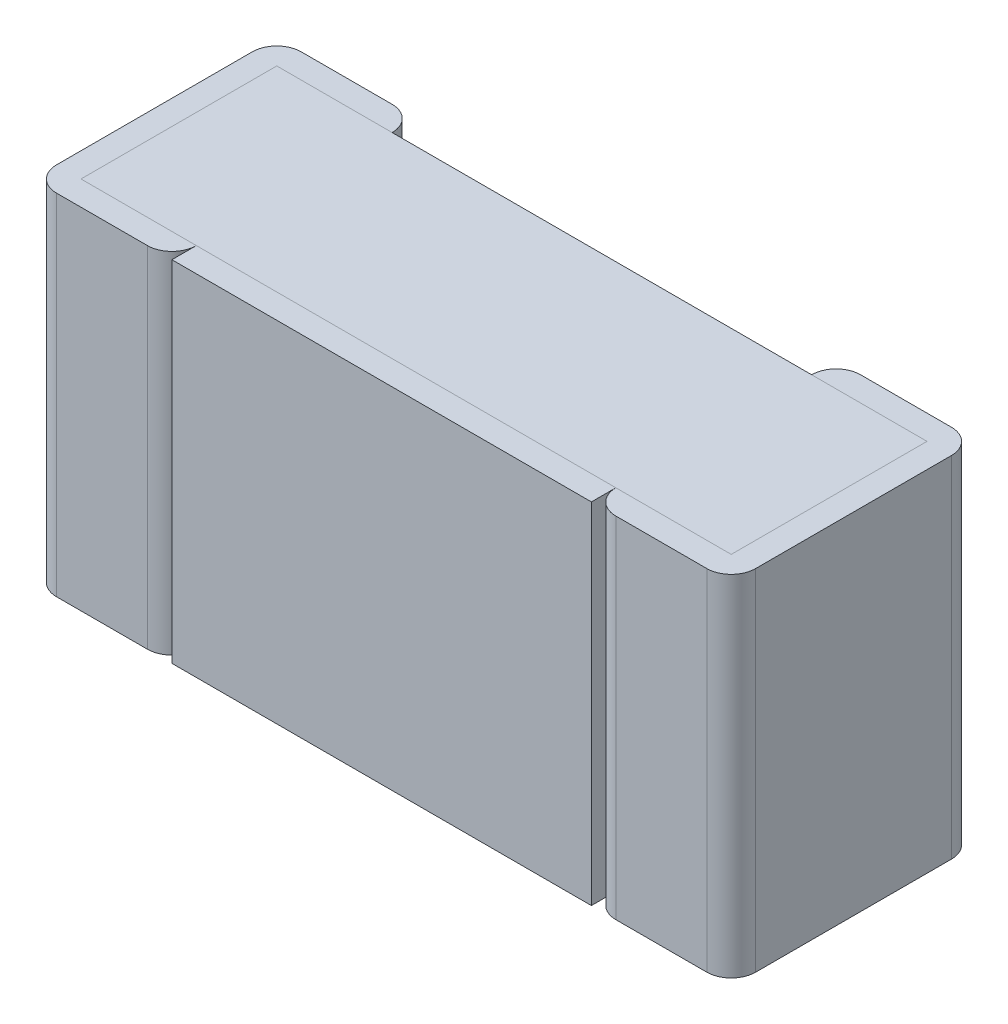
ISO-10303-21;
HEADER;
FILE_DESCRIPTION(('STEP AP214'),'2;1');
FILE_NAME('part.step','',(''),(''),'','','');
FILE_SCHEMA(('AUTOMOTIVE_DESIGN { 1 0 10303 214 1 1 1 1 }'));
ENDSEC;
DATA;
#1=APPLICATION_CONTEXT('core data for automotive mechanical design processes');
#2=APPLICATION_PROTOCOL_DEFINITION('international standard','automotive_design',2000,#1);
#3=PRODUCT_CONTEXT('',#1,'mechanical');
#4=PRODUCT('Part','Part','',(#3));
#5=PRODUCT_RELATED_PRODUCT_CATEGORY('part','',(#4));
#6=PRODUCT_DEFINITION_FORMATION('','',#4);
#7=PRODUCT_DEFINITION_CONTEXT('part definition',#1,'design');
#8=PRODUCT_DEFINITION('design','',#6,#7);
#9=PRODUCT_DEFINITION_SHAPE('','',#8);
#10=(LENGTH_UNIT() NAMED_UNIT(*) SI_UNIT(.MILLI.,.METRE.));
#11=(NAMED_UNIT(*) PLANE_ANGLE_UNIT() SI_UNIT($,.RADIAN.));
#12=(NAMED_UNIT(*) SI_UNIT($,.STERADIAN.) SOLID_ANGLE_UNIT());
#13=UNCERTAINTY_MEASURE_WITH_UNIT(LENGTH_MEASURE(1.E-05),#10,'distance_accuracy_value','');
#14=(GEOMETRIC_REPRESENTATION_CONTEXT(3) GLOBAL_UNCERTAINTY_ASSIGNED_CONTEXT((#13)) GLOBAL_UNIT_ASSIGNED_CONTEXT((#10,
#11,#12)) REPRESENTATION_CONTEXT('',''));
#15=CARTESIAN_POINT('',(0.,0.,0.));
#16=DIRECTION('',(0.,0.,1.));
#17=DIRECTION('',(1.,0.,0.));
#18=AXIS2_PLACEMENT_3D('',#15,#16,#17);
#19=CARTESIAN_POINT('',(-0.3,-0.25,0.35));
#20=DIRECTION('',(0.,0.,1.));
#21=DIRECTION('',(1.,0.,0.));
#22=AXIS2_PLACEMENT_3D('',#19,#20,#21);
#23=PLANE('',#22);
#24=DIRECTION('',(0.,1.,0.));
#25=VECTOR('',#24,1.);
#26=CARTESIAN_POINT('',(-0.3,-0.25,0.35));
#27=LINE('',#26,#25);
#28=CARTESIAN_POINT('',(-0.3,-0.25,0.35));
#29=VERTEX_POINT('',#28);
#30=CARTESIAN_POINT('',(-0.3,0.25,0.35));
#31=VERTEX_POINT('',#30);
#32=EDGE_CURVE('E144',#29,#31,#27,.T.);
#33=ORIENTED_EDGE('',*,*,#32,.F.);
#34=DIRECTION('',(1.,0.,0.));
#35=VECTOR('',#34,1.);
#36=CARTESIAN_POINT('',(-0.3,-0.25,0.35));
#37=LINE('',#36,#35);
#38=CARTESIAN_POINT('',(0.3,-0.25,0.35));
#39=VERTEX_POINT('',#38);
#40=EDGE_CURVE('E347',#29,#39,#37,.T.);
#41=ORIENTED_EDGE('',*,*,#40,.T.);
#42=DIRECTION('',(0.,1.,0.));
#43=VECTOR('',#42,1.);
#44=CARTESIAN_POINT('',(0.3,-0.25,0.35));
#45=LINE('',#44,#43);
#46=CARTESIAN_POINT('',(0.3,0.25,0.35));
#47=VERTEX_POINT('',#46);
#48=EDGE_CURVE('E11',#39,#47,#45,.T.);
#49=ORIENTED_EDGE('',*,*,#48,.T.);
#50=DIRECTION('',(1.,0.,0.));
#51=VECTOR('',#50,1.);
#52=CARTESIAN_POINT('',(-0.3,0.25,0.35));
#53=LINE('',#52,#51);
#54=EDGE_CURVE('E263',#31,#47,#53,.T.);
#55=ORIENTED_EDGE('',*,*,#54,.F.);
#56=EDGE_LOOP('',(#33,#41,#49,#55));
#57=FACE_BOUND('',#56,.T.);
#58=ADVANCED_FACE('F17',(#57),#23,.T.);
#59=CARTESIAN_POINT('',(0.3,-0.25,0.315));
#60=DIRECTION('',(1.,0.,0.));
#61=DIRECTION('',(0.,1.,0.));
#62=AXIS2_PLACEMENT_3D('',#59,#60,#61);
#63=PLANE('',#62);
#64=DIRECTION('',(0.,0.,1.));
#65=VECTOR('',#64,1.);
#66=CARTESIAN_POINT('',(0.3,-0.25,0.315));
#67=LINE('',#66,#65);
#68=CARTESIAN_POINT('',(0.3,-0.25,0.315));
#69=VERTEX_POINT('',#68);
#70=EDGE_CURVE('E279',#69,#39,#67,.T.);
#71=ORIENTED_EDGE('',*,*,#70,.F.);
#72=DIRECTION('',(0.,1.,0.));
#73=VECTOR('',#72,1.);
#74=CARTESIAN_POINT('',(0.3,-0.25,0.315));
#75=LINE('',#74,#73);
#76=CARTESIAN_POINT('',(0.3,0.25,0.315));
#77=VERTEX_POINT('',#76);
#78=EDGE_CURVE('E28',#69,#77,#75,.T.);
#79=ORIENTED_EDGE('',*,*,#78,.T.);
#80=DIRECTION('',(0.,0.,1.));
#81=VECTOR('',#80,1.);
#82=CARTESIAN_POINT('',(0.3,0.25,0.315));
#83=LINE('',#82,#81);
#84=EDGE_CURVE('E267',#77,#47,#83,.T.);
#85=ORIENTED_EDGE('',*,*,#84,.T.);
#86=ORIENTED_EDGE('',*,*,#48,.F.);
#87=EDGE_LOOP('',(#71,#79,#85,#86));
#88=FACE_BOUND('',#87,.T.);
#89=ADVANCED_FACE('F500',(#88),#63,.T.);
#90=CARTESIAN_POINT('',(0.335,-0.25,0.315));
#91=DIRECTION('',(0.,1.,0.));
#92=DIRECTION('',(-1.,0.,0.));
#93=AXIS2_PLACEMENT_3D('',#90,#91,#92);
#94=CYLINDRICAL_SURFACE('',#93,0.035);
#95=CARTESIAN_POINT('',(0.335,-0.25,0.315));
#96=DIRECTION('',(0.,1.,0.));
#97=DIRECTION('',(0.,0.,1.));
#98=AXIS2_PLACEMENT_3D('',#95,#96,#97);
#99=CIRCLE('',#98,0.035);
#100=CARTESIAN_POINT('',(0.335,-0.25,0.35));
#101=VERTEX_POINT('',#100);
#102=EDGE_CURVE('E294',#69,#101,#99,.T.);
#103=ORIENTED_EDGE('',*,*,#102,.T.);
#104=DIRECTION('',(0.,1.,0.));
#105=VECTOR('',#104,1.);
#106=CARTESIAN_POINT('',(0.335,-0.25,0.35));
#107=LINE('',#106,#105);
#108=CARTESIAN_POINT('',(0.335,0.25,0.35));
#109=VERTEX_POINT('',#108);
#110=EDGE_CURVE('E331',#101,#109,#107,.T.);
#111=ORIENTED_EDGE('',*,*,#110,.T.);
#112=CARTESIAN_POINT('',(0.335,0.25,0.315));
#113=DIRECTION('',(0.,1.,0.));
#114=DIRECTION('',(0.,0.,1.));
#115=AXIS2_PLACEMENT_3D('',#112,#113,#114);
#116=CIRCLE('',#115,0.035);
#117=EDGE_CURVE('E314',#77,#109,#116,.T.);
#118=ORIENTED_EDGE('',*,*,#117,.F.);
#119=ORIENTED_EDGE('',*,*,#78,.F.);
#120=EDGE_LOOP('',(#103,#111,#118,#119));
#121=FACE_BOUND('',#120,.T.);
#122=ADVANCED_FACE('F479',(#121),#94,.T.);
#123=CARTESIAN_POINT('',(0.3,-0.25,0.35));
#124=DIRECTION('',(0.,0.,1.));
#125=DIRECTION('',(1.,0.,0.));
#126=AXIS2_PLACEMENT_3D('',#123,#124,#125);
#127=PLANE('',#126);
#128=DIRECTION('',(1.,0.,0.));
#129=VECTOR('',#128,1.);
#130=CARTESIAN_POINT('',(0.3,0.25,0.35));
#131=LINE('',#130,#129);
#132=CARTESIAN_POINT('',(0.465,0.25,0.35));
#133=VERTEX_POINT('',#132);
#134=EDGE_CURVE('E256',#109,#133,#131,.T.);
#135=ORIENTED_EDGE('',*,*,#134,.F.);
#136=ORIENTED_EDGE('',*,*,#110,.F.);
#137=DIRECTION('',(1.,0.,0.));
#138=VECTOR('',#137,1.);
#139=CARTESIAN_POINT('',(0.3,-0.25,0.35));
#140=LINE('',#139,#138);
#141=CARTESIAN_POINT('',(0.465,-0.25,0.35));
#142=VERTEX_POINT('',#141);
#143=EDGE_CURVE('E359',#101,#142,#140,.T.);
#144=ORIENTED_EDGE('',*,*,#143,.T.);
#145=DIRECTION('',(0.,1.,0.));
#146=VECTOR('',#145,1.);
#147=CARTESIAN_POINT('',(0.465,-0.25,0.35));
#148=LINE('',#147,#146);
#149=EDGE_CURVE('E467',#142,#133,#148,.T.);
#150=ORIENTED_EDGE('',*,*,#149,.T.);
#151=EDGE_LOOP('',(#135,#136,#144,#150));
#152=FACE_BOUND('',#151,.T.);
#153=ADVANCED_FACE('F485',(#152),#127,.T.);
#154=CARTESIAN_POINT('',(0.465,-0.25,0.315));
#155=DIRECTION('',(0.,1.,0.));
#156=DIRECTION('',(1.,0.,0.));
#157=AXIS2_PLACEMENT_3D('',#154,#155,#156);
#158=CYLINDRICAL_SURFACE('',#157,0.035);
#159=DIRECTION('',(0.,1.,0.));
#160=VECTOR('',#159,1.);
#161=CARTESIAN_POINT('',(0.5,-0.25,0.315));
#162=LINE('',#161,#160);
#163=CARTESIAN_POINT('',(0.5,-0.25,0.315));
#164=VERTEX_POINT('',#163);
#165=CARTESIAN_POINT('',(0.5,0.25,0.315));
#166=VERTEX_POINT('',#165);
#167=EDGE_CURVE('E328',#164,#166,#162,.T.);
#168=ORIENTED_EDGE('',*,*,#167,.T.);
#169=CARTESIAN_POINT('',(0.465,0.25,0.315));
#170=DIRECTION('',(0.,-1.,0.));
#171=DIRECTION('',(0.,0.,1.));
#172=AXIS2_PLACEMENT_3D('',#169,#170,#171);
#173=CIRCLE('',#172,0.035);
#174=EDGE_CURVE('E21',#166,#133,#173,.T.);
#175=ORIENTED_EDGE('',*,*,#174,.T.);
#176=ORIENTED_EDGE('',*,*,#149,.F.);
#177=CARTESIAN_POINT('',(0.465,-0.25,0.315));
#178=DIRECTION('',(0.,-1.,0.));
#179=DIRECTION('',(0.,0.,1.));
#180=AXIS2_PLACEMENT_3D('',#177,#178,#179);
#181=CIRCLE('',#180,0.035);
#182=EDGE_CURVE('E325',#164,#142,#181,.T.);
#183=ORIENTED_EDGE('',*,*,#182,.F.);
#184=EDGE_LOOP('',(#168,#175,#176,#183));
#185=FACE_BOUND('',#184,.T.);
#186=ADVANCED_FACE('F508',(#185),#158,.T.);
#187=CARTESIAN_POINT('',(0.5,-0.25,0.));
#188=DIRECTION('',(1.,0.,0.));
#189=DIRECTION('',(0.,1.,0.));
#190=AXIS2_PLACEMENT_3D('',#187,#188,#189);
#191=PLANE('',#190);
#192=DIRECTION('',(0.,0.,1.));
#193=VECTOR('',#192,1.);
#194=CARTESIAN_POINT('',(0.5,-0.25,0.));
#195=LINE('',#194,#193);
#196=CARTESIAN_POINT('',(0.5,-0.25,0.035));
#197=VERTEX_POINT('',#196);
#198=EDGE_CURVE('E321',#197,#164,#195,.T.);
#199=ORIENTED_EDGE('',*,*,#198,.F.);
#200=DIRECTION('',(0.,1.,0.));
#201=VECTOR('',#200,1.);
#202=CARTESIAN_POINT('',(0.5,-0.25,0.035));
#203=LINE('',#202,#201);
#204=CARTESIAN_POINT('',(0.5,0.25,0.035));
#205=VERTEX_POINT('',#204);
#206=EDGE_CURVE('E319',#197,#205,#203,.T.);
#207=ORIENTED_EDGE('',*,*,#206,.T.);
#208=DIRECTION('',(0.,0.,1.));
#209=VECTOR('',#208,1.);
#210=CARTESIAN_POINT('',(0.5,0.25,0.));
#211=LINE('',#210,#209);
#212=EDGE_CURVE('E390',#205,#166,#211,.T.);
#213=ORIENTED_EDGE('',*,*,#212,.T.);
#214=ORIENTED_EDGE('',*,*,#167,.F.);
#215=EDGE_LOOP('',(#199,#207,#213,#214));
#216=FACE_BOUND('',#215,.T.);
#217=ADVANCED_FACE('F600',(#216),#191,.T.);
#218=CARTESIAN_POINT('',(0.465,-0.25,0.035));
#219=DIRECTION('',(0.,1.,0.));
#220=DIRECTION('',(1.,0.,0.));
#221=AXIS2_PLACEMENT_3D('',#218,#219,#220);
#222=CYLINDRICAL_SURFACE('',#221,0.035);
#223=CARTESIAN_POINT('',(0.465,-0.25,0.035));
#224=DIRECTION('',(0.,1.,0.));
#225=DIRECTION('',(0.,0.,1.));
#226=AXIS2_PLACEMENT_3D('',#223,#224,#225);
#227=CIRCLE('',#226,0.035);
#228=CARTESIAN_POINT('',(0.465,-0.25,0.));
#229=VERTEX_POINT('',#228);
#230=EDGE_CURVE('E261',#197,#229,#227,.T.);
#231=ORIENTED_EDGE('',*,*,#230,.T.);
#232=DIRECTION('',(0.,1.,0.));
#233=VECTOR('',#232,1.);
#234=CARTESIAN_POINT('',(0.465,-0.25,0.));
#235=LINE('',#234,#233);
#236=CARTESIAN_POINT('',(0.465,0.25,0.));
#237=VERTEX_POINT('',#236);
#238=EDGE_CURVE('E316',#229,#237,#235,.T.);
#239=ORIENTED_EDGE('',*,*,#238,.T.);
#240=CARTESIAN_POINT('',(0.465,0.25,0.035));
#241=DIRECTION('',(0.,1.,0.));
#242=DIRECTION('',(0.,0.,1.));
#243=AXIS2_PLACEMENT_3D('',#240,#241,#242);
#244=CIRCLE('',#243,0.035);
#245=EDGE_CURVE('E268',#205,#237,#244,.T.);
#246=ORIENTED_EDGE('',*,*,#245,.F.);
#247=ORIENTED_EDGE('',*,*,#206,.F.);
#248=EDGE_LOOP('',(#231,#239,#246,#247));
#249=FACE_BOUND('',#248,.T.);
#250=ADVANCED_FACE('F19',(#249),#222,.T.);
#251=CARTESIAN_POINT('',(0.3,-0.25,0.));
#252=DIRECTION('',(0.,0.,1.));
#253=DIRECTION('',(1.,0.,0.));
#254=AXIS2_PLACEMENT_3D('',#251,#252,#253);
#255=PLANE('',#254);
#256=ORIENTED_EDGE('',*,*,#238,.F.);
#257=DIRECTION('',(1.,0.,0.));
#258=VECTOR('',#257,1.);
#259=CARTESIAN_POINT('',(0.3,-0.25,0.));
#260=LINE('',#259,#258);
#261=CARTESIAN_POINT('',(0.335,-0.25,0.));
#262=VERTEX_POINT('',#261);
#263=EDGE_CURVE('E275',#262,#229,#260,.T.);
#264=ORIENTED_EDGE('',*,*,#263,.F.);
#265=DIRECTION('',(0.,1.,0.));
#266=VECTOR('',#265,1.);
#267=CARTESIAN_POINT('',(0.335,-0.25,0.));
#268=LINE('',#267,#266);
#269=CARTESIAN_POINT('',(0.335,0.25,0.));
#270=VERTEX_POINT('',#269);
#271=EDGE_CURVE('E320',#262,#270,#268,.T.);
#272=ORIENTED_EDGE('',*,*,#271,.T.);
#273=DIRECTION('',(1.,0.,0.));
#274=VECTOR('',#273,1.);
#275=CARTESIAN_POINT('',(0.3,0.25,0.));
#276=LINE('',#275,#274);
#277=EDGE_CURVE('E315',#270,#237,#276,.T.);
#278=ORIENTED_EDGE('',*,*,#277,.T.);
#279=EDGE_LOOP('',(#256,#264,#272,#278));
#280=FACE_BOUND('',#279,.T.);
#281=ADVANCED_FACE('F641',(#280),#255,.F.);
#282=CARTESIAN_POINT('',(0.335,-0.25,0.035));
#283=DIRECTION('',(0.,1.,0.));
#284=DIRECTION('',(-1.,0.,0.));
#285=AXIS2_PLACEMENT_3D('',#282,#283,#284);
#286=CYLINDRICAL_SURFACE('',#285,0.035);
#287=DIRECTION('',(0.,1.,0.));
#288=VECTOR('',#287,1.);
#289=CARTESIAN_POINT('',(0.3,-0.25,0.035));
#290=LINE('',#289,#288);
#291=CARTESIAN_POINT('',(0.3,-0.25,0.035));
#292=VERTEX_POINT('',#291);
#293=CARTESIAN_POINT('',(0.3,0.25,0.035));
#294=VERTEX_POINT('',#293);
#295=EDGE_CURVE('E258',#292,#294,#290,.T.);
#296=ORIENTED_EDGE('',*,*,#295,.T.);
#297=CARTESIAN_POINT('',(0.335,0.25,0.035));
#298=DIRECTION('',(0.,-1.,0.));
#299=DIRECTION('',(0.,0.,1.));
#300=AXIS2_PLACEMENT_3D('',#297,#298,#299);
#301=CIRCLE('',#300,0.035);
#302=EDGE_CURVE('E310',#294,#270,#301,.T.);
#303=ORIENTED_EDGE('',*,*,#302,.T.);
#304=ORIENTED_EDGE('',*,*,#271,.F.);
#305=CARTESIAN_POINT('',(0.335,-0.25,0.035));
#306=DIRECTION('',(0.,-1.,0.));
#307=DIRECTION('',(0.,0.,1.));
#308=AXIS2_PLACEMENT_3D('',#305,#306,#307);
#309=CIRCLE('',#308,0.035);
#310=EDGE_CURVE('E280',#292,#262,#309,.T.);
#311=ORIENTED_EDGE('',*,*,#310,.F.);
#312=EDGE_LOOP('',(#296,#303,#304,#311));
#313=FACE_BOUND('',#312,.T.);
#314=ADVANCED_FACE('F646',(#313),#286,.T.);
#315=CARTESIAN_POINT('',(-0.3,0.25,0.315));
#316=DIRECTION('',(0.,1.,0.));
#317=DIRECTION('',(1.,0.,0.));
#318=AXIS2_PLACEMENT_3D('',#315,#316,#317);
#319=PLANE('',#318);
#320=DIRECTION('',(1.,0.,0.));
#321=VECTOR('',#320,1.);
#322=CARTESIAN_POINT('',(-0.3,0.25,0.315));
#323=LINE('',#322,#321);
#324=CARTESIAN_POINT('',(-0.3,0.25,0.315));
#325=VERTEX_POINT('',#324);
#326=EDGE_CURVE('E274',#325,#77,#323,.T.);
#327=ORIENTED_EDGE('',*,*,#326,.F.);
#328=DIRECTION('',(0.,0.,1.));
#329=VECTOR('',#328,1.);
#330=CARTESIAN_POINT('',(-0.3,0.25,0.315));
#331=LINE('',#330,#329);
#332=EDGE_CURVE('E369',#325,#31,#331,.T.);
#333=ORIENTED_EDGE('',*,*,#332,.T.);
#334=ORIENTED_EDGE('',*,*,#54,.T.);
#335=ORIENTED_EDGE('',*,*,#84,.F.);
#336=EDGE_LOOP('',(#327,#333,#334,#335));
#337=FACE_BOUND('',#336,.T.);
#338=ADVANCED_FACE('F499',(#337),#319,.T.);
#339=CARTESIAN_POINT('',(0.3,0.25,0.));
#340=DIRECTION('',(0.,1.,0.));
#341=DIRECTION('',(1.,0.,0.));
#342=AXIS2_PLACEMENT_3D('',#339,#340,#341);
#343=PLANE('',#342);
#344=ORIENTED_EDGE('',*,*,#277,.F.);
#345=ORIENTED_EDGE('',*,*,#302,.F.);
#346=DIRECTION('',(1.,0.,0.));
#347=VECTOR('',#346,1.);
#348=CARTESIAN_POINT('',(-0.465,0.25,0.035));
#349=LINE('',#348,#347);
#350=CARTESIAN_POINT('',(0.465,0.25,0.035));
#351=VERTEX_POINT('',#350);
#352=EDGE_CURVE('E447',#294,#351,#349,.T.);
#353=ORIENTED_EDGE('',*,*,#352,.T.);
#354=DIRECTION('',(0.,0.,1.));
#355=VECTOR('',#354,1.);
#356=CARTESIAN_POINT('',(0.465,0.25,0.035));
#357=LINE('',#356,#355);
#358=CARTESIAN_POINT('',(0.465,0.25,0.315));
#359=VERTEX_POINT('',#358);
#360=EDGE_CURVE('E273',#351,#359,#357,.T.);
#361=ORIENTED_EDGE('',*,*,#360,.T.);
#362=DIRECTION('',(1.,0.,0.));
#363=VECTOR('',#362,1.);
#364=CARTESIAN_POINT('',(-0.465,0.25,0.315));
#365=LINE('',#364,#363);
#366=EDGE_CURVE('E269',#77,#359,#365,.T.);
#367=ORIENTED_EDGE('',*,*,#366,.F.);
#368=ORIENTED_EDGE('',*,*,#117,.T.);
#369=ORIENTED_EDGE('',*,*,#134,.T.);
#370=ORIENTED_EDGE('',*,*,#174,.F.);
#371=ORIENTED_EDGE('',*,*,#212,.F.);
#372=ORIENTED_EDGE('',*,*,#245,.T.);
#373=EDGE_LOOP('',(#344,#345,#353,#361,#367,#368,#369,#370,#371,#372));
#374=FACE_BOUND('',#373,.T.);
#375=ADVANCED_FACE('F490',(#374),#343,.T.);
#376=CARTESIAN_POINT('',(-0.3,-0.25,0.315));
#377=DIRECTION('',(1.,0.,0.));
#378=DIRECTION('',(0.,1.,0.));
#379=AXIS2_PLACEMENT_3D('',#376,#377,#378);
#380=PLANE('',#379);
#381=ORIENTED_EDGE('',*,*,#32,.T.);
#382=ORIENTED_EDGE('',*,*,#332,.F.);
#383=DIRECTION('',(0.,1.,0.));
#384=VECTOR('',#383,1.);
#385=CARTESIAN_POINT('',(-0.3,-0.25,0.315));
#386=LINE('',#385,#384);
#387=CARTESIAN_POINT('',(-0.3,-0.25,0.315));
#388=VERTEX_POINT('',#387);
#389=EDGE_CURVE('E290',#388,#325,#386,.T.);
#390=ORIENTED_EDGE('',*,*,#389,.F.);
#391=DIRECTION('',(0.,0.,1.));
#392=VECTOR('',#391,1.);
#393=CARTESIAN_POINT('',(-0.3,-0.25,0.315));
#394=LINE('',#393,#392);
#395=EDGE_CURVE('E350',#388,#29,#394,.T.);
#396=ORIENTED_EDGE('',*,*,#395,.T.);
#397=EDGE_LOOP('',(#381,#382,#390,#396));
#398=FACE_BOUND('',#397,.T.);
#399=ADVANCED_FACE('F558',(#398),#380,.F.);
#400=CARTESIAN_POINT('',(-0.3,-0.25,0.315));
#401=DIRECTION('',(0.,1.,0.));
#402=DIRECTION('',(1.,0.,0.));
#403=AXIS2_PLACEMENT_3D('',#400,#401,#402);
#404=PLANE('',#403);
#405=ORIENTED_EDGE('',*,*,#70,.T.);
#406=ORIENTED_EDGE('',*,*,#40,.F.);
#407=ORIENTED_EDGE('',*,*,#395,.F.);
#408=DIRECTION('',(1.,0.,0.));
#409=VECTOR('',#408,1.);
#410=CARTESIAN_POINT('',(-0.3,-0.25,0.315));
#411=LINE('',#410,#409);
#412=EDGE_CURVE('E297',#388,#69,#411,.T.);
#413=ORIENTED_EDGE('',*,*,#412,.T.);
#414=EDGE_LOOP('',(#405,#406,#407,#413));
#415=FACE_BOUND('',#414,.T.);
#416=ADVANCED_FACE('F553',(#415),#404,.F.);
#417=CARTESIAN_POINT('',(0.3,-0.25,0.));
#418=DIRECTION('',(0.,1.,0.));
#419=DIRECTION('',(1.,0.,0.));
#420=AXIS2_PLACEMENT_3D('',#417,#418,#419);
#421=PLANE('',#420);
#422=ORIENTED_EDGE('',*,*,#230,.F.);
#423=ORIENTED_EDGE('',*,*,#198,.T.);
#424=ORIENTED_EDGE('',*,*,#182,.T.);
#425=ORIENTED_EDGE('',*,*,#143,.F.);
#426=ORIENTED_EDGE('',*,*,#102,.F.);
#427=DIRECTION('',(1.,0.,0.));
#428=VECTOR('',#427,1.);
#429=CARTESIAN_POINT('',(-0.465,-0.25,0.315));
#430=LINE('',#429,#428);
#431=CARTESIAN_POINT('',(0.465,-0.25,0.315));
#432=VERTEX_POINT('',#431);
#433=EDGE_CURVE('E285',#69,#432,#430,.T.);
#434=ORIENTED_EDGE('',*,*,#433,.T.);
#435=DIRECTION('',(0.,0.,1.));
#436=VECTOR('',#435,1.);
#437=CARTESIAN_POINT('',(0.465,-0.25,0.035));
#438=LINE('',#437,#436);
#439=CARTESIAN_POINT('',(0.465,-0.25,0.035));
#440=VERTEX_POINT('',#439);
#441=EDGE_CURVE('E281',#440,#432,#438,.T.);
#442=ORIENTED_EDGE('',*,*,#441,.F.);
#443=DIRECTION('',(1.,0.,0.));
#444=VECTOR('',#443,1.);
#445=CARTESIAN_POINT('',(-0.465,-0.25,0.035));
#446=LINE('',#445,#444);
#447=EDGE_CURVE('E286',#292,#440,#446,.T.);
#448=ORIENTED_EDGE('',*,*,#447,.F.);
#449=ORIENTED_EDGE('',*,*,#310,.T.);
#450=ORIENTED_EDGE('',*,*,#263,.T.);
#451=EDGE_LOOP('',(#422,#423,#424,#425,#426,#434,#442,#448,#449,#450));
#452=FACE_BOUND('',#451,.T.);
#453=ADVANCED_FACE('F504',(#452),#421,.F.);
#454=CARTESIAN_POINT('',(-0.465,-0.25,0.035));
#455=DIRECTION('',(0.,0.,1.));
#456=DIRECTION('',(1.,0.,0.));
#457=AXIS2_PLACEMENT_3D('',#454,#455,#456);
#458=PLANE('',#457);
#459=DIRECTION('',(1.,0.,0.));
#460=VECTOR('',#459,1.);
#461=CARTESIAN_POINT('',(-0.465,0.25,0.035));
#462=LINE('',#461,#460);
#463=CARTESIAN_POINT('',(-0.3,0.25,0.035));
#464=VERTEX_POINT('',#463);
#465=EDGE_CURVE('E262',#464,#294,#462,.T.);
#466=ORIENTED_EDGE('',*,*,#465,.T.);
#467=ORIENTED_EDGE('',*,*,#295,.F.);
#468=DIRECTION('',(1.,0.,0.));
#469=VECTOR('',#468,1.);
#470=CARTESIAN_POINT('',(-0.465,-0.25,0.035));
#471=LINE('',#470,#469);
#472=CARTESIAN_POINT('',(-0.3,-0.25,0.035));
#473=VERTEX_POINT('',#472);
#474=EDGE_CURVE('E345',#473,#292,#471,.T.);
#475=ORIENTED_EDGE('',*,*,#474,.F.);
#476=DIRECTION('',(0.,1.,0.));
#477=VECTOR('',#476,1.);
#478=CARTESIAN_POINT('',(-0.3,-0.25,0.035));
#479=LINE('',#478,#477);
#480=EDGE_CURVE('E341',#473,#464,#479,.T.);
#481=ORIENTED_EDGE('',*,*,#480,.T.);
#482=EDGE_LOOP('',(#466,#467,#475,#481));
#483=FACE_BOUND('',#482,.T.);
#484=ADVANCED_FACE('F587',(#483),#458,.F.);
#485=CARTESIAN_POINT('',(-0.465,0.25,0.035));
#486=DIRECTION('',(0.,1.,0.));
#487=DIRECTION('',(1.,0.,0.));
#488=AXIS2_PLACEMENT_3D('',#485,#486,#487);
#489=PLANE('',#488);
#490=DIRECTION('',(1.,0.,0.));
#491=VECTOR('',#490,1.);
#492=CARTESIAN_POINT('',(-0.465,0.25,0.035));
#493=LINE('',#492,#491);
#494=CARTESIAN_POINT('',(-0.465,0.25,0.035));
#495=VERTEX_POINT('',#494);
#496=EDGE_CURVE('E334',#495,#464,#493,.T.);
#497=ORIENTED_EDGE('',*,*,#496,.F.);
#498=DIRECTION('',(0.,0.,1.));
#499=VECTOR('',#498,1.);
#500=CARTESIAN_POINT('',(-0.465,0.25,0.035));
#501=LINE('',#500,#499);
#502=CARTESIAN_POINT('',(-0.465,0.25,0.315));
#503=VERTEX_POINT('',#502);
#504=EDGE_CURVE('E306',#495,#503,#501,.T.);
#505=ORIENTED_EDGE('',*,*,#504,.T.);
#506=DIRECTION('',(1.,0.,0.));
#507=VECTOR('',#506,1.);
#508=CARTESIAN_POINT('',(-0.465,0.25,0.315));
#509=LINE('',#508,#507);
#510=EDGE_CURVE('E302',#503,#325,#509,.T.);
#511=ORIENTED_EDGE('',*,*,#510,.T.);
#512=ORIENTED_EDGE('',*,*,#326,.T.);
#513=ORIENTED_EDGE('',*,*,#366,.T.);
#514=ORIENTED_EDGE('',*,*,#360,.F.);
#515=ORIENTED_EDGE('',*,*,#352,.F.);
#516=ORIENTED_EDGE('',*,*,#465,.F.);
#517=EDGE_LOOP('',(#497,#505,#511,#512,#513,#514,#515,#516));
#518=FACE_BOUND('',#517,.T.);
#519=ADVANCED_FACE('F494',(#518),#489,.T.);
#520=CARTESIAN_POINT('',(-0.335,-0.25,0.315));
#521=DIRECTION('',(0.,1.,0.));
#522=DIRECTION('',(1.,0.,0.));
#523=AXIS2_PLACEMENT_3D('',#520,#521,#522);
#524=CYLINDRICAL_SURFACE('',#523,0.035);
#525=ORIENTED_EDGE('',*,*,#389,.T.);
#526=CARTESIAN_POINT('',(-0.335,0.25,0.315));
#527=DIRECTION('',(0.,-1.,0.));
#528=DIRECTION('',(0.,0.,1.));
#529=AXIS2_PLACEMENT_3D('',#526,#527,#528);
#530=CIRCLE('',#529,0.035);
#531=CARTESIAN_POINT('',(-0.335,0.25,0.35));
#532=VERTEX_POINT('',#531);
#533=EDGE_CURVE('E228',#325,#532,#530,.T.);
#534=ORIENTED_EDGE('',*,*,#533,.T.);
#535=DIRECTION('',(0.,1.,0.));
#536=VECTOR('',#535,1.);
#537=CARTESIAN_POINT('',(-0.335,-0.25,0.35));
#538=LINE('',#537,#536);
#539=CARTESIAN_POINT('',(-0.335,-0.25,0.35));
#540=VERTEX_POINT('',#539);
#541=EDGE_CURVE('E223',#540,#532,#538,.T.);
#542=ORIENTED_EDGE('',*,*,#541,.F.);
#543=CARTESIAN_POINT('',(-0.335,-0.25,0.315));
#544=DIRECTION('',(0.,-1.,0.));
#545=DIRECTION('',(0.,0.,1.));
#546=AXIS2_PLACEMENT_3D('',#543,#544,#545);
#547=CIRCLE('',#546,0.035);
#548=EDGE_CURVE('E301',#388,#540,#547,.T.);
#549=ORIENTED_EDGE('',*,*,#548,.F.);
#550=EDGE_LOOP('',(#525,#534,#542,#549));
#551=FACE_BOUND('',#550,.T.);
#552=ADVANCED_FACE('F412',(#551),#524,.T.);
#553=CARTESIAN_POINT('',(-0.5,-0.25,0.35));
#554=DIRECTION('',(0.,0.,1.));
#555=DIRECTION('',(1.,0.,0.));
#556=AXIS2_PLACEMENT_3D('',#553,#554,#555);
#557=PLANE('',#556);
#558=DIRECTION('',(1.,0.,0.));
#559=VECTOR('',#558,1.);
#560=CARTESIAN_POINT('',(-0.5,0.25,0.35));
#561=LINE('',#560,#559);
#562=CARTESIAN_POINT('',(-0.465,0.25,0.35));
#563=VERTEX_POINT('',#562);
#564=EDGE_CURVE('E216',#563,#532,#561,.T.);
#565=ORIENTED_EDGE('',*,*,#564,.F.);
#566=DIRECTION('',(0.,1.,0.));
#567=VECTOR('',#566,1.);
#568=CARTESIAN_POINT('',(-0.465,-0.25,0.35));
#569=LINE('',#568,#567);
#570=CARTESIAN_POINT('',(-0.465,-0.25,0.35));
#571=VERTEX_POINT('',#570);
#572=EDGE_CURVE('E221',#571,#563,#569,.T.);
#573=ORIENTED_EDGE('',*,*,#572,.F.);
#574=DIRECTION('',(1.,0.,0.));
#575=VECTOR('',#574,1.);
#576=CARTESIAN_POINT('',(-0.5,-0.25,0.35));
#577=LINE('',#576,#575);
#578=EDGE_CURVE('E298',#571,#540,#577,.T.);
#579=ORIENTED_EDGE('',*,*,#578,.T.);
#580=ORIENTED_EDGE('',*,*,#541,.T.);
#581=EDGE_LOOP('',(#565,#573,#579,#580));
#582=FACE_BOUND('',#581,.T.);
#583=ADVANCED_FACE('F218',(#582),#557,.T.);
#584=CARTESIAN_POINT('',(-0.465,-0.25,0.035));
#585=DIRECTION('',(0.,1.,0.));
#586=DIRECTION('',(1.,0.,0.));
#587=AXIS2_PLACEMENT_3D('',#584,#585,#586);
#588=PLANE('',#587);
#589=ORIENTED_EDGE('',*,*,#474,.T.);
#590=ORIENTED_EDGE('',*,*,#447,.T.);
#591=ORIENTED_EDGE('',*,*,#441,.T.);
#592=ORIENTED_EDGE('',*,*,#433,.F.);
#593=ORIENTED_EDGE('',*,*,#412,.F.);
#594=DIRECTION('',(1.,0.,0.));
#595=VECTOR('',#594,1.);
#596=CARTESIAN_POINT('',(-0.465,-0.25,0.315));
#597=LINE('',#596,#595);
#598=CARTESIAN_POINT('',(-0.465,-0.25,0.315));
#599=VERTEX_POINT('',#598);
#600=EDGE_CURVE('E355',#599,#388,#597,.T.);
#601=ORIENTED_EDGE('',*,*,#600,.F.);
#602=DIRECTION('',(0.,0.,1.));
#603=VECTOR('',#602,1.);
#604=CARTESIAN_POINT('',(-0.465,-0.25,0.035));
#605=LINE('',#604,#603);
#606=CARTESIAN_POINT('',(-0.465,-0.25,0.035));
#607=VERTEX_POINT('',#606);
#608=EDGE_CURVE('E339',#607,#599,#605,.T.);
#609=ORIENTED_EDGE('',*,*,#608,.F.);
#610=DIRECTION('',(1.,0.,0.));
#611=VECTOR('',#610,1.);
#612=CARTESIAN_POINT('',(-0.465,-0.25,0.035));
#613=LINE('',#612,#611);
#614=EDGE_CURVE('E335',#607,#473,#613,.T.);
#615=ORIENTED_EDGE('',*,*,#614,.T.);
#616=EDGE_LOOP('',(#589,#590,#591,#592,#593,#601,#609,#615));
#617=FACE_BOUND('',#616,.T.);
#618=ADVANCED_FACE('F405',(#617),#588,.F.);
#619=CARTESIAN_POINT('',(-0.335,-0.25,0.035));
#620=DIRECTION('',(0.,1.,0.));
#621=DIRECTION('',(1.,0.,0.));
#622=AXIS2_PLACEMENT_3D('',#619,#620,#621);
#623=CYLINDRICAL_SURFACE('',#622,0.035);
#624=CARTESIAN_POINT('',(-0.335,-0.25,0.035));
#625=DIRECTION('',(0.,1.,0.));
#626=DIRECTION('',(0.,0.,1.));
#627=AXIS2_PLACEMENT_3D('',#624,#625,#626);
#628=CIRCLE('',#627,0.035);
#629=CARTESIAN_POINT('',(-0.335,-0.25,0.));
#630=VERTEX_POINT('',#629);
#631=EDGE_CURVE('E340',#473,#630,#628,.T.);
#632=ORIENTED_EDGE('',*,*,#631,.T.);
#633=DIRECTION('',(0.,1.,0.));
#634=VECTOR('',#633,1.);
#635=CARTESIAN_POINT('',(-0.335,-0.25,0.));
#636=LINE('',#635,#634);
#637=CARTESIAN_POINT('',(-0.335,0.25,0.));
#638=VERTEX_POINT('',#637);
#639=EDGE_CURVE('E346',#630,#638,#636,.T.);
#640=ORIENTED_EDGE('',*,*,#639,.T.);
#641=CARTESIAN_POINT('',(-0.335,0.25,0.035));
#642=DIRECTION('',(0.,1.,0.));
#643=DIRECTION('',(0.,0.,1.));
#644=AXIS2_PLACEMENT_3D('',#641,#642,#643);
#645=CIRCLE('',#644,0.035);
#646=EDGE_CURVE('E376',#464,#638,#645,.T.);
#647=ORIENTED_EDGE('',*,*,#646,.F.);
#648=ORIENTED_EDGE('',*,*,#480,.F.);
#649=EDGE_LOOP('',(#632,#640,#647,#648));
#650=FACE_BOUND('',#649,.T.);
#651=ADVANCED_FACE('F568',(#650),#623,.T.);
#652=CARTESIAN_POINT('',(-0.5,-0.25,0.));
#653=DIRECTION('',(0.,0.,1.));
#654=DIRECTION('',(1.,0.,0.));
#655=AXIS2_PLACEMENT_3D('',#652,#653,#654);
#656=PLANE('',#655);
#657=ORIENTED_EDGE('',*,*,#639,.F.);
#658=DIRECTION('',(1.,0.,0.));
#659=VECTOR('',#658,1.);
#660=CARTESIAN_POINT('',(-0.5,-0.25,0.));
#661=LINE('',#660,#659);
#662=CARTESIAN_POINT('',(-0.465,-0.25,0.));
#663=VERTEX_POINT('',#662);
#664=EDGE_CURVE('E354',#663,#630,#661,.T.);
#665=ORIENTED_EDGE('',*,*,#664,.F.);
#666=DIRECTION('',(0.,1.,0.));
#667=VECTOR('',#666,1.);
#668=CARTESIAN_POINT('',(-0.465,-0.25,0.));
#669=LINE('',#668,#667);
#670=CARTESIAN_POINT('',(-0.465,0.25,0.));
#671=VERTEX_POINT('',#670);
#672=EDGE_CURVE('E245',#663,#671,#669,.T.);
#673=ORIENTED_EDGE('',*,*,#672,.T.);
#674=DIRECTION('',(1.,0.,0.));
#675=VECTOR('',#674,1.);
#676=CARTESIAN_POINT('',(-0.5,0.25,0.));
#677=LINE('',#676,#675);
#678=EDGE_CURVE('E229',#671,#638,#677,.T.);
#679=ORIENTED_EDGE('',*,*,#678,.T.);
#680=EDGE_LOOP('',(#657,#665,#673,#679));
#681=FACE_BOUND('',#680,.T.);
#682=ADVANCED_FACE('F546',(#681),#656,.F.);
#683=CARTESIAN_POINT('',(-0.5,0.25,0.));
#684=DIRECTION('',(0.,1.,0.));
#685=DIRECTION('',(1.,0.,0.));
#686=AXIS2_PLACEMENT_3D('',#683,#684,#685);
#687=PLANE('',#686);
#688=ORIENTED_EDGE('',*,*,#678,.F.);
#689=CARTESIAN_POINT('',(-0.465,0.25,0.035));
#690=DIRECTION('',(0.,-1.,0.));
#691=DIRECTION('',(0.,0.,1.));
#692=AXIS2_PLACEMENT_3D('',#689,#690,#691);
#693=CIRCLE('',#692,0.035);
#694=CARTESIAN_POINT('',(-0.5,0.25,0.035));
#695=VERTEX_POINT('',#694);
#696=EDGE_CURVE('E252',#695,#671,#693,.T.);
#697=ORIENTED_EDGE('',*,*,#696,.F.);
#698=DIRECTION('',(0.,0.,1.));
#699=VECTOR('',#698,1.);
#700=CARTESIAN_POINT('',(-0.5,0.25,0.));
#701=LINE('',#700,#699);
#702=CARTESIAN_POINT('',(-0.5,0.25,0.315));
#703=VERTEX_POINT('',#702);
#704=EDGE_CURVE('E235',#695,#703,#701,.T.);
#705=ORIENTED_EDGE('',*,*,#704,.T.);
#706=CARTESIAN_POINT('',(-0.465,0.25,0.315));
#707=DIRECTION('',(0.,1.,0.));
#708=DIRECTION('',(0.,0.,1.));
#709=AXIS2_PLACEMENT_3D('',#706,#707,#708);
#710=CIRCLE('',#709,0.035);
#711=EDGE_CURVE('E232',#703,#563,#710,.T.);
#712=ORIENTED_EDGE('',*,*,#711,.T.);
#713=ORIENTED_EDGE('',*,*,#564,.T.);
#714=ORIENTED_EDGE('',*,*,#533,.F.);
#715=ORIENTED_EDGE('',*,*,#510,.F.);
#716=ORIENTED_EDGE('',*,*,#504,.F.);
#717=ORIENTED_EDGE('',*,*,#496,.T.);
#718=ORIENTED_EDGE('',*,*,#646,.T.);
#719=EDGE_LOOP('',(#688,#697,#705,#712,#713,#714,#715,#716,#717,#718));
#720=FACE_BOUND('',#719,.T.);
#721=ADVANCED_FACE('F233',(#720),#687,.T.);
#722=CARTESIAN_POINT('',(-0.465,-0.25,0.315));
#723=DIRECTION('',(0.,1.,0.));
#724=DIRECTION('',(-1.,0.,0.));
#725=AXIS2_PLACEMENT_3D('',#722,#723,#724);
#726=CYLINDRICAL_SURFACE('',#725,0.035);
#727=CARTESIAN_POINT('',(-0.465,-0.25,0.315));
#728=DIRECTION('',(0.,1.,0.));
#729=DIRECTION('',(0.,0.,1.));
#730=AXIS2_PLACEMENT_3D('',#727,#728,#729);
#731=CIRCLE('',#730,0.035);
#732=CARTESIAN_POINT('',(-0.5,-0.25,0.315));
#733=VERTEX_POINT('',#732);
#734=EDGE_CURVE('E242',#733,#571,#731,.T.);
#735=ORIENTED_EDGE('',*,*,#734,.T.);
#736=ORIENTED_EDGE('',*,*,#572,.T.);
#737=ORIENTED_EDGE('',*,*,#711,.F.);
#738=DIRECTION('',(0.,1.,0.));
#739=VECTOR('',#738,1.);
#740=CARTESIAN_POINT('',(-0.5,-0.25,0.315));
#741=LINE('',#740,#739);
#742=EDGE_CURVE('E373',#733,#703,#741,.T.);
#743=ORIENTED_EDGE('',*,*,#742,.F.);
#744=EDGE_LOOP('',(#735,#736,#737,#743));
#745=FACE_BOUND('',#744,.T.);
#746=ADVANCED_FACE('F241',(#745),#726,.T.);
#747=CARTESIAN_POINT('',(-0.465,-0.25,0.035));
#748=DIRECTION('',(0.,1.,0.));
#749=DIRECTION('',(-1.,0.,0.));
#750=AXIS2_PLACEMENT_3D('',#747,#748,#749);
#751=CYLINDRICAL_SURFACE('',#750,0.035);
#752=DIRECTION('',(0.,1.,0.));
#753=VECTOR('',#752,1.);
#754=CARTESIAN_POINT('',(-0.5,-0.25,0.035));
#755=LINE('',#754,#753);
#756=CARTESIAN_POINT('',(-0.5,-0.25,0.035));
#757=VERTEX_POINT('',#756);
#758=EDGE_CURVE('E372',#757,#695,#755,.T.);
#759=ORIENTED_EDGE('',*,*,#758,.T.);
#760=ORIENTED_EDGE('',*,*,#696,.T.);
#761=ORIENTED_EDGE('',*,*,#672,.F.);
#762=CARTESIAN_POINT('',(-0.465,-0.25,0.035));
#763=DIRECTION('',(0.,-1.,0.));
#764=DIRECTION('',(0.,0.,1.));
#765=AXIS2_PLACEMENT_3D('',#762,#763,#764);
#766=CIRCLE('',#765,0.035);
#767=EDGE_CURVE('E420',#757,#663,#766,.T.);
#768=ORIENTED_EDGE('',*,*,#767,.F.);
#769=EDGE_LOOP('',(#759,#760,#761,#768));
#770=FACE_BOUND('',#769,.T.);
#771=ADVANCED_FACE('F612',(#770),#751,.T.);
#772=CARTESIAN_POINT('',(-0.5,-0.25,0.));
#773=DIRECTION('',(0.,1.,0.));
#774=DIRECTION('',(1.,0.,0.));
#775=AXIS2_PLACEMENT_3D('',#772,#773,#774);
#776=PLANE('',#775);
#777=ORIENTED_EDGE('',*,*,#631,.F.);
#778=ORIENTED_EDGE('',*,*,#614,.F.);
#779=ORIENTED_EDGE('',*,*,#608,.T.);
#780=ORIENTED_EDGE('',*,*,#600,.T.);
#781=ORIENTED_EDGE('',*,*,#548,.T.);
#782=ORIENTED_EDGE('',*,*,#578,.F.);
#783=ORIENTED_EDGE('',*,*,#734,.F.);
#784=DIRECTION('',(0.,0.,1.));
#785=VECTOR('',#784,1.);
#786=CARTESIAN_POINT('',(-0.5,-0.25,0.));
#787=LINE('',#786,#785);
#788=EDGE_CURVE('E417',#757,#733,#787,.T.);
#789=ORIENTED_EDGE('',*,*,#788,.F.);
#790=ORIENTED_EDGE('',*,*,#767,.T.);
#791=ORIENTED_EDGE('',*,*,#664,.T.);
#792=EDGE_LOOP('',(#777,#778,#779,#780,#781,#782,#783,#789,#790,#791));
#793=FACE_BOUND('',#792,.T.);
#794=ADVANCED_FACE('F403',(#793),#776,.F.);
#795=CARTESIAN_POINT('',(-0.5,-0.25,0.));
#796=DIRECTION('',(1.,0.,0.));
#797=DIRECTION('',(0.,1.,0.));
#798=AXIS2_PLACEMENT_3D('',#795,#796,#797);
#799=PLANE('',#798);
#800=ORIENTED_EDGE('',*,*,#742,.T.);
#801=ORIENTED_EDGE('',*,*,#704,.F.);
#802=ORIENTED_EDGE('',*,*,#758,.F.);
#803=ORIENTED_EDGE('',*,*,#788,.T.);
#804=EDGE_LOOP('',(#800,#801,#802,#803));
#805=FACE_BOUND('',#804,.T.);
#806=ADVANCED_FACE('F423',(#805),#799,.F.);
#807=CLOSED_SHELL('',(#58,#89,#122,#153,#186,#217,#250,#281,#314,#338,#375,#399,#416,#453,#484,
#519,#552,#583,#618,#651,#682,#721,#746,#771,#794,#806));
#808=MANIFOLD_SOLID_BREP('B1',#807);
#809=ADVANCED_BREP_SHAPE_REPRESENTATION('',(#18,#808),#14);
#810=SHAPE_DEFINITION_REPRESENTATION(#9,#809);
ENDSEC;
END-ISO-10303-21;
